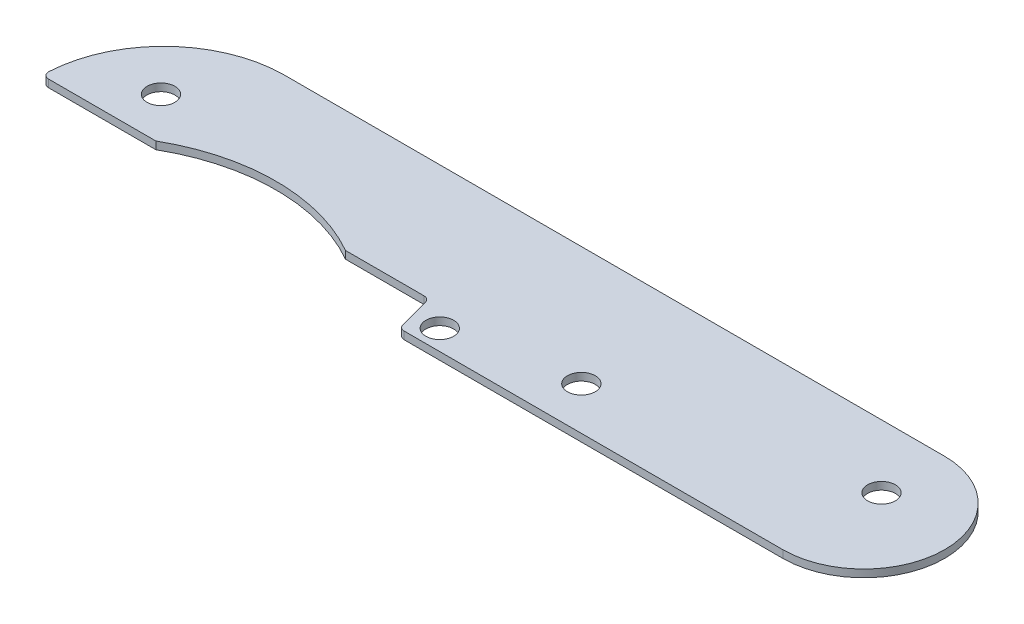
ISO-10303-21;
HEADER;
FILE_DESCRIPTION(('STEP AP214'),'2;1');
FILE_NAME('part.step','',(''),(''),'','','');
FILE_SCHEMA(('AUTOMOTIVE_DESIGN { 1 0 10303 214 1 1 1 1 }'));
ENDSEC;
DATA;
#1=APPLICATION_CONTEXT('core data for automotive mechanical design processes');
#2=APPLICATION_PROTOCOL_DEFINITION('international standard','automotive_design',2000,#1);
#3=PRODUCT_CONTEXT('',#1,'mechanical');
#4=PRODUCT('Part','Part','',(#3));
#5=PRODUCT_RELATED_PRODUCT_CATEGORY('part','',(#4));
#6=PRODUCT_DEFINITION_FORMATION('','',#4);
#7=PRODUCT_DEFINITION_CONTEXT('part definition',#1,'design');
#8=PRODUCT_DEFINITION('design','',#6,#7);
#9=PRODUCT_DEFINITION_SHAPE('','',#8);
#10=(LENGTH_UNIT() NAMED_UNIT(*) SI_UNIT(.MILLI.,.METRE.));
#11=(NAMED_UNIT(*) PLANE_ANGLE_UNIT() SI_UNIT($,.RADIAN.));
#12=(NAMED_UNIT(*) SI_UNIT($,.STERADIAN.) SOLID_ANGLE_UNIT());
#13=UNCERTAINTY_MEASURE_WITH_UNIT(LENGTH_MEASURE(1.E-05),#10,'distance_accuracy_value','');
#14=(GEOMETRIC_REPRESENTATION_CONTEXT(3) GLOBAL_UNCERTAINTY_ASSIGNED_CONTEXT((#13)) GLOBAL_UNIT_ASSIGNED_CONTEXT((#10,
#11,#12)) REPRESENTATION_CONTEXT('',''));
#15=CARTESIAN_POINT('',(0.,0.,0.));
#16=DIRECTION('',(0.,0.,1.));
#17=DIRECTION('',(1.,0.,0.));
#18=AXIS2_PLACEMENT_3D('',#15,#16,#17);
#19=CARTESIAN_POINT('',(0.,0.762,0.));
#20=DIRECTION('',(0.,-1.,0.));
#21=DIRECTION('',(0.,0.,-1.));
#22=AXIS2_PLACEMENT_3D('',#19,#20,#21);
#23=CYLINDRICAL_SURFACE('',#22,8.128);
#24=CARTESIAN_POINT('',(0.,0.,0.));
#25=DIRECTION('',(0.,1.,0.));
#26=DIRECTION('',(0.,0.,1.));
#27=AXIS2_PLACEMENT_3D('',#24,#25,#26);
#28=CIRCLE('',#27,8.128);
#29=CARTESIAN_POINT('',(0.,0.,8.128));
#30=VERTEX_POINT('',#29);
#31=CARTESIAN_POINT('',(0.,0.,-8.128));
#32=VERTEX_POINT('',#31);
#33=EDGE_CURVE('E152',#30,#32,#28,.T.);
#34=ORIENTED_EDGE('',*,*,#33,.T.);
#35=DIRECTION('',(0.,-1.,0.));
#36=VECTOR('',#35,1.);
#37=CARTESIAN_POINT('',(0.,0.762,-8.128));
#38=LINE('',#37,#36);
#39=CARTESIAN_POINT('',(0.,0.762,-8.128));
#40=VERTEX_POINT('',#39);
#41=EDGE_CURVE('E132',#40,#32,#38,.T.);
#42=ORIENTED_EDGE('',*,*,#41,.F.);
#43=CARTESIAN_POINT('',(0.,0.762,0.));
#44=DIRECTION('',(0.,1.,0.));
#45=DIRECTION('',(0.,0.,1.));
#46=AXIS2_PLACEMENT_3D('',#43,#44,#45);
#47=CIRCLE('',#46,8.128);
#48=CARTESIAN_POINT('',(0.,0.762,8.128));
#49=VERTEX_POINT('',#48);
#50=EDGE_CURVE('E140',#49,#40,#47,.T.);
#51=ORIENTED_EDGE('',*,*,#50,.F.);
#52=DIRECTION('',(0.,-1.,0.));
#53=VECTOR('',#52,1.);
#54=CARTESIAN_POINT('',(0.,0.762,8.128));
#55=LINE('',#54,#53);
#56=EDGE_CURVE('E227',#49,#30,#55,.T.);
#57=ORIENTED_EDGE('',*,*,#56,.T.);
#58=EDGE_LOOP('',(#34,#42,#51,#57));
#59=FACE_BOUND('',#58,.T.);
#60=ADVANCED_FACE('F43',(#59),#23,.T.);
#61=CARTESIAN_POINT('',(0.,0.762,-8.128));
#62=DIRECTION('',(0.,0.,1.));
#63=DIRECTION('',(1.,0.,0.));
#64=AXIS2_PLACEMENT_3D('',#61,#62,#63);
#65=PLANE('',#64);
#66=DIRECTION('',(-1.,0.,0.));
#67=VECTOR('',#66,1.);
#68=CARTESIAN_POINT('',(0.,0.,-8.128));
#69=LINE('',#68,#67);
#70=CARTESIAN_POINT('',(-66.294,0.,-8.12799999999999));
#71=VERTEX_POINT('',#70);
#72=EDGE_CURVE('E235',#32,#71,#69,.T.);
#73=ORIENTED_EDGE('',*,*,#72,.T.);
#74=DIRECTION('',(0.,-1.,0.));
#75=VECTOR('',#74,1.);
#76=CARTESIAN_POINT('',(-66.294,0.762,-8.12799999999999));
#77=LINE('',#76,#75);
#78=CARTESIAN_POINT('',(-66.294,0.762,-8.12799999999999));
#79=VERTEX_POINT('',#78);
#80=EDGE_CURVE('E135',#79,#71,#77,.T.);
#81=ORIENTED_EDGE('',*,*,#80,.F.);
#82=DIRECTION('',(-1.,0.,0.));
#83=VECTOR('',#82,1.);
#84=CARTESIAN_POINT('',(0.,0.762,-8.128));
#85=LINE('',#84,#83);
#86=EDGE_CURVE('E128',#40,#79,#85,.T.);
#87=ORIENTED_EDGE('',*,*,#86,.F.);
#88=ORIENTED_EDGE('',*,*,#41,.T.);
#89=EDGE_LOOP('',(#73,#81,#87,#88));
#90=FACE_BOUND('',#89,.T.);
#91=ADVANCED_FACE('F130',(#90),#65,.F.);
#92=CARTESIAN_POINT('',(-66.294,0.762,4.06400000000001));
#93=DIRECTION('',(0.,-1.,0.));
#94=DIRECTION('',(0.,0.,-1.));
#95=AXIS2_PLACEMENT_3D('',#92,#93,#94);
#96=CYLINDRICAL_SURFACE('',#95,12.192);
#97=CARTESIAN_POINT('',(-66.294,0.,4.06400000000001));
#98=DIRECTION('',(0.,1.,0.));
#99=DIRECTION('',(0.,0.,1.));
#100=AXIS2_PLACEMENT_3D('',#97,#98,#99);
#101=CIRCLE('',#100,12.192);
#102=CARTESIAN_POINT('',(-78.4675825146368,0.,3.3941098901099));
#103=VERTEX_POINT('',#102);
#104=EDGE_CURVE('E239',#71,#103,#101,.T.);
#105=ORIENTED_EDGE('',*,*,#104,.T.);
#106=DIRECTION('',(0.,-1.,0.));
#107=VECTOR('',#106,1.);
#108=CARTESIAN_POINT('',(-78.4675825146368,0.762,3.3941098901099));
#109=LINE('',#108,#107);
#110=CARTESIAN_POINT('',(-78.4675825146368,0.762,3.3941098901099));
#111=VERTEX_POINT('',#110);
#112=EDGE_CURVE('E172',#103,#111,#109,.F.);
#113=ORIENTED_EDGE('',*,*,#112,.T.);
#114=CARTESIAN_POINT('',(-66.294,0.762,4.06400000000001));
#115=DIRECTION('',(0.,1.,0.));
#116=DIRECTION('',(0.,0.,1.));
#117=AXIS2_PLACEMENT_3D('',#114,#115,#116);
#118=CIRCLE('',#117,12.192);
#119=EDGE_CURVE('E139',#79,#111,#118,.T.);
#120=ORIENTED_EDGE('',*,*,#119,.F.);
#121=ORIENTED_EDGE('',*,*,#80,.T.);
#122=EDGE_LOOP('',(#105,#113,#120,#121));
#123=FACE_BOUND('',#122,.T.);
#124=ADVANCED_FACE('F274',(#123),#96,.T.);
#125=CARTESIAN_POINT('',(-78.486,0.762,4.06400000000001));
#126=DIRECTION('',(0.,0.,-1.));
#127=DIRECTION('',(-1.,0.,0.));
#128=AXIS2_PLACEMENT_3D('',#125,#126,#127);
#129=PLANE('',#128);
#130=DIRECTION('',(1.,0.,0.));
#131=VECTOR('',#130,1.);
#132=CARTESIAN_POINT('',(-78.486,0.762,4.06400000000001));
#133=LINE('',#132,#131);
#134=CARTESIAN_POINT('',(-77.8335417586661,0.762,4.06400000000001));
#135=VERTEX_POINT('',#134);
#136=CARTESIAN_POINT('',(-67.056,0.762,4.06400000000001));
#137=VERTEX_POINT('',#136);
#138=EDGE_CURVE('E268',#135,#137,#133,.T.);
#139=ORIENTED_EDGE('',*,*,#138,.F.);
#140=DIRECTION('',(0.,-1.,0.));
#141=VECTOR('',#140,1.);
#142=CARTESIAN_POINT('',(-77.8335417586661,0.762,4.06400000000001));
#143=LINE('',#142,#141);
#144=CARTESIAN_POINT('',(-77.8335417586661,0.,4.06400000000001));
#145=VERTEX_POINT('',#144);
#146=EDGE_CURVE('E154',#135,#145,#143,.T.);
#147=ORIENTED_EDGE('',*,*,#146,.T.);
#148=DIRECTION('',(1.,0.,0.));
#149=VECTOR('',#148,1.);
#150=CARTESIAN_POINT('',(-78.486,0.,4.06400000000001));
#151=LINE('',#150,#149);
#152=CARTESIAN_POINT('',(-67.056,0.,4.06400000000001));
#153=VERTEX_POINT('',#152);
#154=EDGE_CURVE('E243',#145,#153,#151,.T.);
#155=ORIENTED_EDGE('',*,*,#154,.T.);
#156=DIRECTION('',(0.,-1.,0.));
#157=VECTOR('',#156,1.);
#158=CARTESIAN_POINT('',(-67.056,0.762,4.06400000000001));
#159=LINE('',#158,#157);
#160=EDGE_CURVE('E163',#137,#153,#159,.T.);
#161=ORIENTED_EDGE('',*,*,#160,.F.);
#162=EDGE_LOOP('',(#139,#147,#155,#161));
#163=FACE_BOUND('',#162,.T.);
#164=ADVANCED_FACE('F266',(#163),#129,.F.);
#165=CARTESIAN_POINT('',(-57.531,0.762,20.653375));
#166=DIRECTION('',(0.,-1.,0.));
#167=DIRECTION('',(0.,0.,-1.));
#168=AXIS2_PLACEMENT_3D('',#165,#166,#167);
#169=CYLINDRICAL_SURFACE('',#168,19.129375);
#170=CARTESIAN_POINT('',(-57.531,0.,20.653375));
#171=DIRECTION('',(0.,-1.,0.));
#172=DIRECTION('',(0.,0.,-1.));
#173=AXIS2_PLACEMENT_3D('',#170,#171,#172);
#174=CIRCLE('',#173,19.129375);
#175=CARTESIAN_POINT('',(-48.006,0.,4.06400000000001));
#176=VERTEX_POINT('',#175);
#177=EDGE_CURVE('E215',#153,#176,#174,.T.);
#178=ORIENTED_EDGE('',*,*,#177,.T.);
#179=DIRECTION('',(0.,-1.,0.));
#180=VECTOR('',#179,1.);
#181=CARTESIAN_POINT('',(-48.006,0.762,4.06400000000001));
#182=LINE('',#181,#180);
#183=CARTESIAN_POINT('',(-48.006,0.762,4.06400000000001));
#184=VERTEX_POINT('',#183);
#185=EDGE_CURVE('E213',#184,#176,#182,.T.);
#186=ORIENTED_EDGE('',*,*,#185,.F.);
#187=CARTESIAN_POINT('',(-57.531,0.762,20.653375));
#188=DIRECTION('',(0.,-1.,0.));
#189=DIRECTION('',(0.,0.,-1.));
#190=AXIS2_PLACEMENT_3D('',#187,#188,#189);
#191=CIRCLE('',#190,19.129375);
#192=EDGE_CURVE('E229',#137,#184,#191,.T.);
#193=ORIENTED_EDGE('',*,*,#192,.F.);
#194=ORIENTED_EDGE('',*,*,#160,.T.);
#195=EDGE_LOOP('',(#178,#186,#193,#194));
#196=FACE_BOUND('',#195,.T.);
#197=ADVANCED_FACE('F262',(#196),#169,.F.);
#198=CARTESIAN_POINT('',(-48.006,0.762,4.06400000000001));
#199=DIRECTION('',(0.,0.,-1.));
#200=DIRECTION('',(-1.,0.,0.));
#201=AXIS2_PLACEMENT_3D('',#198,#199,#200);
#202=PLANE('',#201);
#203=DIRECTION('',(1.,0.,0.));
#204=VECTOR('',#203,1.);
#205=CARTESIAN_POINT('',(-48.006,0.,4.06400000000001));
#206=LINE('',#205,#204);
#207=CARTESIAN_POINT('',(-40.1112526373666,0.,4.06400000000001));
#208=VERTEX_POINT('',#207);
#209=EDGE_CURVE('E202',#176,#208,#206,.T.);
#210=ORIENTED_EDGE('',*,*,#209,.T.);
#211=DIRECTION('',(0.,-1.,0.));
#212=VECTOR('',#211,1.);
#213=CARTESIAN_POINT('',(-40.1112526373666,0.762,4.06400000000001));
#214=LINE('',#213,#212);
#215=CARTESIAN_POINT('',(-40.1112526373666,0.762,4.06400000000001));
#216=VERTEX_POINT('',#215);
#217=EDGE_CURVE('E190',#208,#216,#214,.F.);
#218=ORIENTED_EDGE('',*,*,#217,.T.);
#219=DIRECTION('',(1.,0.,0.));
#220=VECTOR('',#219,1.);
#221=CARTESIAN_POINT('',(-48.006,0.762,4.06400000000001));
#222=LINE('',#221,#220);
#223=EDGE_CURVE('E219',#184,#216,#222,.T.);
#224=ORIENTED_EDGE('',*,*,#223,.F.);
#225=ORIENTED_EDGE('',*,*,#185,.T.);
#226=EDGE_LOOP('',(#210,#218,#224,#225));
#227=FACE_BOUND('',#226,.T.);
#228=ADVANCED_FACE('F209',(#227),#202,.F.);
#229=CARTESIAN_POINT('',(-39.624,0.762,4.06400000000001));
#230=DIRECTION('',(0.965925826289069,0.,-0.258819045102518));
#231=DIRECTION('',(-0.258819045102519,0.,-0.965925826289069));
#232=AXIS2_PLACEMENT_3D('',#229,#230,#231);
#233=PLANE('',#232);
#234=DIRECTION('',(0.258819045102518,0.,0.965925826289069));
#235=VECTOR('',#234,1.);
#236=CARTESIAN_POINT('',(-39.624,0.,4.06400000000001));
#237=LINE('',#236,#235);
#238=CARTESIAN_POINT('',(-39.4978897376731,0.,4.53464990635991));
#239=VERTEX_POINT('',#238);
#240=CARTESIAN_POINT('',(-38.6611647442868,0.,7.6573500936401));
#241=VERTEX_POINT('',#240);
#242=EDGE_CURVE('E203',#239,#241,#237,.T.);
#243=ORIENTED_EDGE('',*,*,#242,.T.);
#244=DIRECTION('',(0.,-1.,0.));
#245=VECTOR('',#244,1.);
#246=CARTESIAN_POINT('',(-38.6611647442868,0.762,7.6573500936401));
#247=LINE('',#246,#245);
#248=CARTESIAN_POINT('',(-38.6611647442868,0.762,7.6573500936401));
#249=VERTEX_POINT('',#248);
#250=EDGE_CURVE('E67',#241,#249,#247,.F.);
#251=ORIENTED_EDGE('',*,*,#250,.T.);
#252=DIRECTION('',(0.258819045102518,0.,0.965925826289069));
#253=VECTOR('',#252,1.);
#254=CARTESIAN_POINT('',(-39.624,0.762,4.06400000000001));
#255=LINE('',#254,#253);
#256=CARTESIAN_POINT('',(-39.4978897376731,0.762,4.53464990635991));
#257=VERTEX_POINT('',#256);
#258=EDGE_CURVE('E218',#257,#249,#255,.T.);
#259=ORIENTED_EDGE('',*,*,#258,.F.);
#260=DIRECTION('',(0.,-1.,0.));
#261=VECTOR('',#260,1.);
#262=CARTESIAN_POINT('',(-39.4978897376731,0.,4.53464990635991));
#263=LINE('',#262,#261);
#264=EDGE_CURVE('E184',#257,#239,#263,.T.);
#265=ORIENTED_EDGE('',*,*,#264,.T.);
#266=EDGE_LOOP('',(#243,#251,#259,#265));
#267=FACE_BOUND('',#266,.T.);
#268=ADVANCED_FACE('F220',(#267),#233,.F.);
#269=CARTESIAN_POINT('',(-38.5350544819599,0.762,8.128));
#270=DIRECTION('',(0.,0.,-1.));
#271=DIRECTION('',(-1.,0.,0.));
#272=AXIS2_PLACEMENT_3D('',#269,#270,#271);
#273=PLANE('',#272);
#274=DIRECTION('',(1.,0.,0.));
#275=VECTOR('',#274,1.);
#276=CARTESIAN_POINT('',(-38.5350544819599,0.762,8.128));
#277=LINE('',#276,#275);
#278=CARTESIAN_POINT('',(-38.0478018445933,0.762,8.128));
#279=VERTEX_POINT('',#278);
#280=EDGE_CURVE('E144',#279,#49,#277,.T.);
#281=ORIENTED_EDGE('',*,*,#280,.F.);
#282=DIRECTION('',(0.,-1.,0.));
#283=VECTOR('',#282,1.);
#284=CARTESIAN_POINT('',(-38.0478018445933,0.762,8.128));
#285=LINE('',#284,#283);
#286=CARTESIAN_POINT('',(-38.0478018445933,0.,8.128));
#287=VERTEX_POINT('',#286);
#288=EDGE_CURVE('E180',#279,#287,#285,.T.);
#289=ORIENTED_EDGE('',*,*,#288,.T.);
#290=DIRECTION('',(1.,0.,0.));
#291=VECTOR('',#290,1.);
#292=CARTESIAN_POINT('',(-38.5350544819599,0.,8.128));
#293=LINE('',#292,#291);
#294=EDGE_CURVE('E149',#287,#30,#293,.T.);
#295=ORIENTED_EDGE('',*,*,#294,.T.);
#296=ORIENTED_EDGE('',*,*,#56,.F.);
#297=EDGE_LOOP('',(#281,#289,#295,#296));
#298=FACE_BOUND('',#297,.T.);
#299=ADVANCED_FACE('F361',(#298),#273,.F.);
#300=CARTESIAN_POINT('',(0.,0.762,0.));
#301=DIRECTION('',(0.,1.,0.));
#302=DIRECTION('',(0.,0.,1.));
#303=AXIS2_PLACEMENT_3D('',#300,#301,#302);
#304=PLANE('',#303);
#305=CARTESIAN_POINT('',(-70.866,0.762,-0.253999999999993));
#306=DIRECTION('',(0.,1.,0.));
#307=DIRECTION('',(0.,0.,1.));
#308=AXIS2_PLACEMENT_3D('',#305,#306,#307);
#309=CIRCLE('',#308,1.397);
#310=CARTESIAN_POINT('',(-70.866,0.762,1.143));
#311=VERTEX_POINT('',#310);
#312=EDGE_CURVE('E348',#311,#311,#309,.T.);
#313=ORIENTED_EDGE('',*,*,#312,.F.);
#314=EDGE_LOOP('',(#313));
#315=FACE_BOUND('',#314,.T.);
#316=CARTESIAN_POINT('',(-36.5030544819599,0.762,6.096));
#317=DIRECTION('',(0.,1.,0.));
#318=DIRECTION('',(0.,0.,1.));
#319=AXIS2_PLACEMENT_3D('',#316,#317,#318);
#320=CIRCLE('',#319,1.397);
#321=CARTESIAN_POINT('',(-36.5030544819599,0.762,7.493));
#322=VERTEX_POINT('',#321);
#323=EDGE_CURVE('E336',#322,#322,#320,.T.);
#324=ORIENTED_EDGE('',*,*,#323,.F.);
#325=EDGE_LOOP('',(#324));
#326=FACE_BOUND('',#325,.T.);
#327=CARTESIAN_POINT('',(-24.5650544819599,0.762,3.81));
#328=DIRECTION('',(0.,1.,0.));
#329=DIRECTION('',(0.,0.,1.));
#330=AXIS2_PLACEMENT_3D('',#327,#328,#329);
#331=CIRCLE('',#330,1.397);
#332=CARTESIAN_POINT('',(-24.5650544819599,0.762,5.207));
#333=VERTEX_POINT('',#332);
#334=EDGE_CURVE('E324',#333,#333,#331,.T.);
#335=ORIENTED_EDGE('',*,*,#334,.F.);
#336=EDGE_LOOP('',(#335));
#337=FACE_BOUND('',#336,.T.);
#338=CARTESIAN_POINT('',(0.,0.762,-1.778));
#339=DIRECTION('',(0.,1.,0.));
#340=DIRECTION('',(0.,0.,1.));
#341=AXIS2_PLACEMENT_3D('',#338,#339,#340);
#342=CIRCLE('',#341,1.397);
#343=CARTESIAN_POINT('',(0.,0.762,-0.381000000000001));
#344=VERTEX_POINT('',#343);
#345=EDGE_CURVE('E312',#344,#344,#342,.T.);
#346=ORIENTED_EDGE('',*,*,#345,.F.);
#347=EDGE_LOOP('',(#346));
#348=FACE_BOUND('',#347,.T.);
#349=ORIENTED_EDGE('',*,*,#119,.T.);
#350=CARTESIAN_POINT('',(-77.8335417586661,0.762,3.42900000000001));
#351=DIRECTION('',(0.,1.,0.));
#352=DIRECTION('',(0.,0.,1.));
#353=AXIS2_PLACEMENT_3D('',#350,#351,#352);
#354=CIRCLE('',#353,0.635);
#355=EDGE_CURVE('E177',#111,#135,#354,.T.);
#356=ORIENTED_EDGE('',*,*,#355,.T.);
#357=ORIENTED_EDGE('',*,*,#138,.T.);
#358=ORIENTED_EDGE('',*,*,#192,.T.);
#359=ORIENTED_EDGE('',*,*,#223,.T.);
#360=CARTESIAN_POINT('',(-40.1112526373666,0.762,4.69900000000001));
#361=DIRECTION('',(0.,1.,0.));
#362=DIRECTION('',(0.,0.,1.));
#363=AXIS2_PLACEMENT_3D('',#360,#361,#362);
#364=CIRCLE('',#363,0.635);
#365=EDGE_CURVE('E11',#216,#257,#364,.F.);
#366=ORIENTED_EDGE('',*,*,#365,.T.);
#367=ORIENTED_EDGE('',*,*,#258,.T.);
#368=CARTESIAN_POINT('',(-38.0478018445933,0.762,7.493));
#369=DIRECTION('',(0.,1.,0.));
#370=DIRECTION('',(0.,0.,1.));
#371=AXIS2_PLACEMENT_3D('',#368,#369,#370);
#372=CIRCLE('',#371,0.635);
#373=EDGE_CURVE('E59',#249,#279,#372,.T.);
#374=ORIENTED_EDGE('',*,*,#373,.T.);
#375=ORIENTED_EDGE('',*,*,#280,.T.);
#376=ORIENTED_EDGE('',*,*,#50,.T.);
#377=ORIENTED_EDGE('',*,*,#86,.T.);
#378=EDGE_LOOP('',(#349,#356,#357,#358,#359,#366,#367,#374,#375,#376,#377));
#379=FACE_BOUND('',#378,.T.);
#380=ADVANCED_FACE('F143',(#315,#326,#337,#348,#379),#304,.T.);
#381=CARTESIAN_POINT('',(0.,0.,0.));
#382=DIRECTION('',(0.,1.,0.));
#383=DIRECTION('',(0.,0.,1.));
#384=AXIS2_PLACEMENT_3D('',#381,#382,#383);
#385=PLANE('',#384);
#386=CARTESIAN_POINT('',(-70.866,0.,-0.253999999999993));
#387=DIRECTION('',(0.,1.,0.));
#388=DIRECTION('',(0.,0.,1.));
#389=AXIS2_PLACEMENT_3D('',#386,#387,#388);
#390=CIRCLE('',#389,1.397);
#391=CARTESIAN_POINT('',(-70.866,0.,1.143));
#392=VERTEX_POINT('',#391);
#393=EDGE_CURVE('E342',#392,#392,#390,.T.);
#394=ORIENTED_EDGE('',*,*,#393,.T.);
#395=EDGE_LOOP('',(#394));
#396=FACE_BOUND('',#395,.T.);
#397=CARTESIAN_POINT('',(-36.5030544819599,0.,6.096));
#398=DIRECTION('',(0.,1.,0.));
#399=DIRECTION('',(0.,0.,1.));
#400=AXIS2_PLACEMENT_3D('',#397,#398,#399);
#401=CIRCLE('',#400,1.397);
#402=CARTESIAN_POINT('',(-36.5030544819599,0.,7.493));
#403=VERTEX_POINT('',#402);
#404=EDGE_CURVE('E330',#403,#403,#401,.T.);
#405=ORIENTED_EDGE('',*,*,#404,.T.);
#406=EDGE_LOOP('',(#405));
#407=FACE_BOUND('',#406,.T.);
#408=CARTESIAN_POINT('',(-24.5650544819599,0.,3.81));
#409=DIRECTION('',(0.,1.,0.));
#410=DIRECTION('',(0.,0.,1.));
#411=AXIS2_PLACEMENT_3D('',#408,#409,#410);
#412=CIRCLE('',#411,1.397);
#413=CARTESIAN_POINT('',(-24.5650544819599,0.,5.207));
#414=VERTEX_POINT('',#413);
#415=EDGE_CURVE('E318',#414,#414,#412,.T.);
#416=ORIENTED_EDGE('',*,*,#415,.T.);
#417=EDGE_LOOP('',(#416));
#418=FACE_BOUND('',#417,.T.);
#419=CARTESIAN_POINT('',(0.,0.,-1.778));
#420=DIRECTION('',(0.,1.,0.));
#421=DIRECTION('',(0.,0.,1.));
#422=AXIS2_PLACEMENT_3D('',#419,#420,#421);
#423=CIRCLE('',#422,1.397);
#424=CARTESIAN_POINT('',(0.,0.,-0.381000000000001));
#425=VERTEX_POINT('',#424);
#426=EDGE_CURVE('E236',#425,#425,#423,.T.);
#427=ORIENTED_EDGE('',*,*,#426,.T.);
#428=EDGE_LOOP('',(#427));
#429=FACE_BOUND('',#428,.T.);
#430=ORIENTED_EDGE('',*,*,#154,.F.);
#431=CARTESIAN_POINT('',(-77.8335417586661,0.,3.42900000000001));
#432=DIRECTION('',(0.,1.,0.));
#433=DIRECTION('',(0.,0.,1.));
#434=AXIS2_PLACEMENT_3D('',#431,#432,#433);
#435=CIRCLE('',#434,0.635);
#436=EDGE_CURVE('E169',#145,#103,#435,.F.);
#437=ORIENTED_EDGE('',*,*,#436,.T.);
#438=ORIENTED_EDGE('',*,*,#104,.F.);
#439=ORIENTED_EDGE('',*,*,#72,.F.);
#440=ORIENTED_EDGE('',*,*,#33,.F.);
#441=ORIENTED_EDGE('',*,*,#294,.F.);
#442=CARTESIAN_POINT('',(-38.0478018445933,0.,7.493));
#443=DIRECTION('',(0.,1.,0.));
#444=DIRECTION('',(0.,0.,1.));
#445=AXIS2_PLACEMENT_3D('',#442,#443,#444);
#446=CIRCLE('',#445,0.635);
#447=EDGE_CURVE('E161',#287,#241,#446,.F.);
#448=ORIENTED_EDGE('',*,*,#447,.T.);
#449=ORIENTED_EDGE('',*,*,#242,.F.);
#450=CARTESIAN_POINT('',(-40.1112526373666,0.,4.69900000000001));
#451=DIRECTION('',(0.,1.,0.));
#452=DIRECTION('',(0.,0.,1.));
#453=AXIS2_PLACEMENT_3D('',#450,#451,#452);
#454=CIRCLE('',#453,0.635);
#455=EDGE_CURVE('E52',#239,#208,#454,.T.);
#456=ORIENTED_EDGE('',*,*,#455,.T.);
#457=ORIENTED_EDGE('',*,*,#209,.F.);
#458=ORIENTED_EDGE('',*,*,#177,.F.);
#459=EDGE_LOOP('',(#430,#437,#438,#439,#440,#441,#448,#449,#456,#457,#458));
#460=FACE_BOUND('',#459,.T.);
#461=ADVANCED_FACE('F200',(#396,#407,#418,#429,#460),#385,.F.);
#462=CARTESIAN_POINT('',(0.,0.762,-1.778));
#463=DIRECTION('',(0.,1.,0.));
#464=DIRECTION('',(0.,0.,1.));
#465=AXIS2_PLACEMENT_3D('',#462,#463,#464);
#466=CYLINDRICAL_SURFACE('',#465,1.397);
#467=ORIENTED_EDGE('',*,*,#426,.F.);
#468=EDGE_LOOP('',(#467));
#469=FACE_BOUND('',#468,.T.);
#470=ORIENTED_EDGE('',*,*,#345,.T.);
#471=EDGE_LOOP('',(#470));
#472=FACE_BOUND('',#471,.T.);
#473=ADVANCED_FACE('F369',(#469,#472),#466,.F.);
#474=CARTESIAN_POINT('',(-24.5650544819599,0.762,3.81));
#475=DIRECTION('',(0.,1.,0.));
#476=DIRECTION('',(0.,0.,1.));
#477=AXIS2_PLACEMENT_3D('',#474,#475,#476);
#478=CYLINDRICAL_SURFACE('',#477,1.397);
#479=ORIENTED_EDGE('',*,*,#415,.F.);
#480=EDGE_LOOP('',(#479));
#481=FACE_BOUND('',#480,.T.);
#482=ORIENTED_EDGE('',*,*,#334,.T.);
#483=EDGE_LOOP('',(#482));
#484=FACE_BOUND('',#483,.T.);
#485=ADVANCED_FACE('F371',(#481,#484),#478,.F.);
#486=CARTESIAN_POINT('',(-36.5030544819599,0.762,6.096));
#487=DIRECTION('',(0.,1.,0.));
#488=DIRECTION('',(0.,0.,1.));
#489=AXIS2_PLACEMENT_3D('',#486,#487,#488);
#490=CYLINDRICAL_SURFACE('',#489,1.397);
#491=ORIENTED_EDGE('',*,*,#404,.F.);
#492=EDGE_LOOP('',(#491));
#493=FACE_BOUND('',#492,.T.);
#494=ORIENTED_EDGE('',*,*,#323,.T.);
#495=EDGE_LOOP('',(#494));
#496=FACE_BOUND('',#495,.T.);
#497=ADVANCED_FACE('F378',(#493,#496),#490,.F.);
#498=CARTESIAN_POINT('',(-70.866,0.762,-0.253999999999993));
#499=DIRECTION('',(0.,1.,0.));
#500=DIRECTION('',(0.,0.,1.));
#501=AXIS2_PLACEMENT_3D('',#498,#499,#500);
#502=CYLINDRICAL_SURFACE('',#501,1.397);
#503=ORIENTED_EDGE('',*,*,#393,.F.);
#504=EDGE_LOOP('',(#503));
#505=FACE_BOUND('',#504,.T.);
#506=ORIENTED_EDGE('',*,*,#312,.T.);
#507=EDGE_LOOP('',(#506));
#508=FACE_BOUND('',#507,.T.);
#509=ADVANCED_FACE('F357',(#505,#508),#502,.F.);
#510=CARTESIAN_POINT('',(-77.8335417586661,0.762,3.42900000000001));
#511=DIRECTION('',(0.,-1.,0.));
#512=DIRECTION('',(0.,0.,-1.));
#513=AXIS2_PLACEMENT_3D('',#510,#511,#512);
#514=CYLINDRICAL_SURFACE('',#513,0.635);
#515=ORIENTED_EDGE('',*,*,#355,.F.);
#516=ORIENTED_EDGE('',*,*,#112,.F.);
#517=ORIENTED_EDGE('',*,*,#436,.F.);
#518=ORIENTED_EDGE('',*,*,#146,.F.);
#519=EDGE_LOOP('',(#515,#516,#517,#518));
#520=FACE_BOUND('',#519,.T.);
#521=ADVANCED_FACE('F271',(#520),#514,.T.);
#522=CARTESIAN_POINT('',(-38.0478018445933,0.762,7.493));
#523=DIRECTION('',(0.,-1.,0.));
#524=DIRECTION('',(0.,0.,-1.));
#525=AXIS2_PLACEMENT_3D('',#522,#523,#524);
#526=CYLINDRICAL_SURFACE('',#525,0.635);
#527=ORIENTED_EDGE('',*,*,#373,.F.);
#528=ORIENTED_EDGE('',*,*,#250,.F.);
#529=ORIENTED_EDGE('',*,*,#447,.F.);
#530=ORIENTED_EDGE('',*,*,#288,.F.);
#531=EDGE_LOOP('',(#527,#528,#529,#530));
#532=FACE_BOUND('',#531,.T.);
#533=ADVANCED_FACE('F393',(#532),#526,.T.);
#534=CARTESIAN_POINT('',(-40.1112526373666,0.762,4.69900000000001));
#535=DIRECTION('',(0.,1.,0.));
#536=DIRECTION('',(0.,0.,1.));
#537=AXIS2_PLACEMENT_3D('',#534,#535,#536);
#538=CYLINDRICAL_SURFACE('',#537,0.635);
#539=ORIENTED_EDGE('',*,*,#365,.F.);
#540=ORIENTED_EDGE('',*,*,#217,.F.);
#541=ORIENTED_EDGE('',*,*,#455,.F.);
#542=ORIENTED_EDGE('',*,*,#264,.F.);
#543=EDGE_LOOP('',(#539,#540,#541,#542));
#544=FACE_BOUND('',#543,.T.);
#545=ADVANCED_FACE('F45',(#544),#538,.F.);
#546=CLOSED_SHELL('',(#60,#91,#124,#164,#197,#228,#268,#299,#380,#461,#473,#485,#497,#509,#521,
#533,#545));
#547=MANIFOLD_SOLID_BREP('B2',#546);
#548=ADVANCED_BREP_SHAPE_REPRESENTATION('',(#18,#547),#14);
#549=SHAPE_DEFINITION_REPRESENTATION(#9,#548);
ENDSEC;
END-ISO-10303-21;
